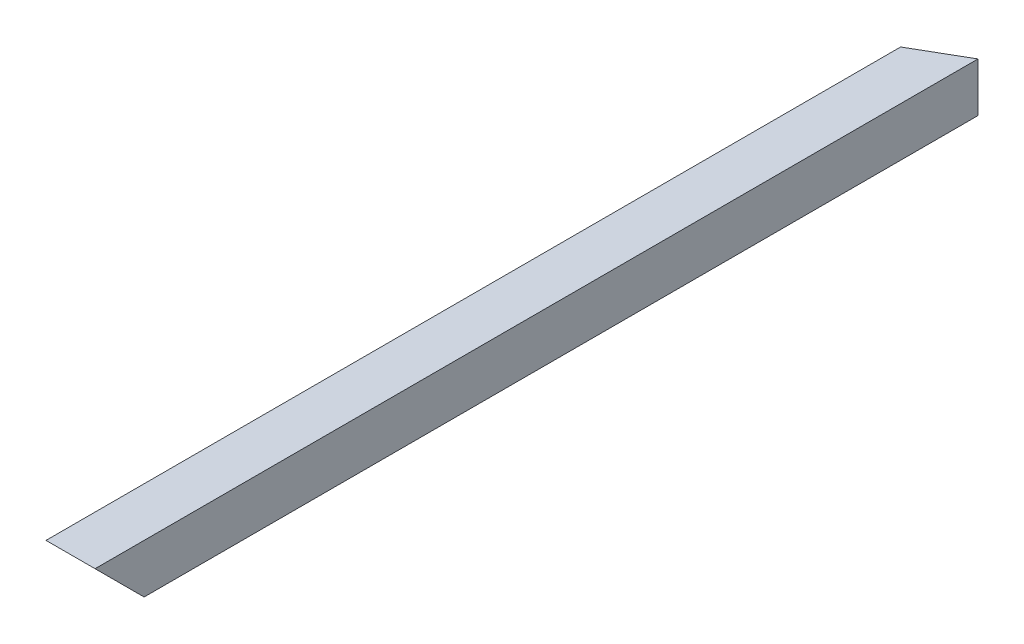
ISO-10303-21;
HEADER;
FILE_DESCRIPTION(('STEP AP214'),'2;1');
FILE_NAME('part.step','',(''),(''),'','','');
FILE_SCHEMA(('AUTOMOTIVE_DESIGN { 1 0 10303 214 1 1 1 1 }'));
ENDSEC;
DATA;
#1=APPLICATION_CONTEXT('core data for automotive mechanical design processes');
#2=APPLICATION_PROTOCOL_DEFINITION('international standard','automotive_design',2000,#1);
#3=PRODUCT_CONTEXT('',#1,'mechanical');
#4=PRODUCT('Part','Part','',(#3));
#5=PRODUCT_RELATED_PRODUCT_CATEGORY('part','',(#4));
#6=PRODUCT_DEFINITION_FORMATION('','',#4);
#7=PRODUCT_DEFINITION_CONTEXT('part definition',#1,'design');
#8=PRODUCT_DEFINITION('design','',#6,#7);
#9=PRODUCT_DEFINITION_SHAPE('','',#8);
#10=(LENGTH_UNIT() NAMED_UNIT(*) SI_UNIT(.MILLI.,.METRE.));
#11=(NAMED_UNIT(*) PLANE_ANGLE_UNIT() SI_UNIT($,.RADIAN.));
#12=(NAMED_UNIT(*) SI_UNIT($,.STERADIAN.) SOLID_ANGLE_UNIT());
#13=UNCERTAINTY_MEASURE_WITH_UNIT(LENGTH_MEASURE(1.E-05),#10,'distance_accuracy_value','');
#14=(GEOMETRIC_REPRESENTATION_CONTEXT(3) GLOBAL_UNCERTAINTY_ASSIGNED_CONTEXT((#13)) GLOBAL_UNIT_ASSIGNED_CONTEXT((#10,
#11,#12)) REPRESENTATION_CONTEXT('',''));
#15=CARTESIAN_POINT('',(0.,0.,0.));
#16=DIRECTION('',(0.,0.,1.));
#17=DIRECTION('',(1.,0.,0.));
#18=AXIS2_PLACEMENT_3D('',#15,#16,#17);
#19=CARTESIAN_POINT('',(-12.7,12.7,-213.935303162583));
#20=DIRECTION('',(0.500000000000001,0.,0.866025403784438));
#21=DIRECTION('',(0.866025403784438,0.,-0.500000000000001));
#22=AXIS2_PLACEMENT_3D('',#19,#20,#21);
#23=PLANE('',#22);
#24=DIRECTION('',(0.866025403784438,0.,-0.500000000000001));
#25=VECTOR('',#24,1.);
#26=CARTESIAN_POINT('',(-49.4933518262807,-12.7,-192.692651581292));
#27=LINE('',#26,#25);
#28=CARTESIAN_POINT('',(-12.7,-12.7,-213.935303162583));
#29=VERTEX_POINT('',#28);
#30=CARTESIAN_POINT('',(12.7,-12.7,-228.6));
#31=VERTEX_POINT('',#30);
#32=EDGE_CURVE('E35',#29,#31,#27,.T.);
#33=ORIENTED_EDGE('',*,*,#32,.F.);
#34=DIRECTION('',(0.,-1.,0.));
#35=VECTOR('',#34,1.);
#36=CARTESIAN_POINT('',(-12.7,0.,-213.935303162584));
#37=LINE('',#36,#35);
#38=CARTESIAN_POINT('',(-12.7,12.7,-213.935303162583));
#39=VERTEX_POINT('',#38);
#40=EDGE_CURVE('E128',#39,#29,#37,.T.);
#41=ORIENTED_EDGE('',*,*,#40,.F.);
#42=DIRECTION('',(-0.866025403784438,0.,0.500000000000001));
#43=VECTOR('',#42,1.);
#44=CARTESIAN_POINT('',(-59.0183518262807,12.7,-187.193390267261));
#45=LINE('',#44,#43);
#46=CARTESIAN_POINT('',(12.7,12.7,-228.6));
#47=VERTEX_POINT('',#46);
#48=EDGE_CURVE('E124',#47,#39,#45,.T.);
#49=ORIENTED_EDGE('',*,*,#48,.F.);
#50=DIRECTION('',(0.,1.,0.));
#51=VECTOR('',#50,1.);
#52=CARTESIAN_POINT('',(12.7,12.7,-228.6));
#53=LINE('',#52,#51);
#54=EDGE_CURVE('E122',#31,#47,#53,.T.);
#55=ORIENTED_EDGE('',*,*,#54,.F.);
#56=EDGE_LOOP('',(#33,#41,#49,#55));
#57=FACE_BOUND('',#56,.T.);
#58=DIRECTION('',(0.,1.,0.));
#59=VECTOR('',#58,1.);
#60=CARTESIAN_POINT('',(-9.52500000000001,1.5875,-215.768390267261));
#61=LINE('',#60,#59);
#62=CARTESIAN_POINT('',(-9.525,-9.525,-215.768390267261));
#63=VERTEX_POINT('',#62);
#64=CARTESIAN_POINT('',(-9.525,9.525,-215.768390267261));
#65=VERTEX_POINT('',#64);
#66=EDGE_CURVE('E108',#63,#65,#61,.T.);
#67=ORIENTED_EDGE('',*,*,#66,.F.);
#68=DIRECTION('',(-0.866025403784438,0.,0.500000000000001));
#69=VECTOR('',#68,1.);
#70=CARTESIAN_POINT('',(-50.6839768262807,-9.525,-192.005243917038));
#71=LINE('',#70,#69);
#72=CARTESIAN_POINT('',(9.525,-9.525,-226.766912895323));
#73=VERTEX_POINT('',#72);
#74=EDGE_CURVE('E134',#73,#63,#71,.T.);
#75=ORIENTED_EDGE('',*,*,#74,.F.);
#76=DIRECTION('',(0.,-1.,0.));
#77=VECTOR('',#76,1.);
#78=CARTESIAN_POINT('',(9.52500000000001,11.1125,-226.766912895323));
#79=LINE('',#78,#77);
#80=CARTESIAN_POINT('',(9.525,9.525,-226.766912895323));
#81=VERTEX_POINT('',#80);
#82=EDGE_CURVE('E10',#81,#73,#79,.T.);
#83=ORIENTED_EDGE('',*,*,#82,.F.);
#84=DIRECTION('',(0.866025403784438,0.,-0.500000000000001));
#85=VECTOR('',#84,1.);
#86=CARTESIAN_POINT('',(-57.8277268262807,9.525,-187.880797931514));
#87=LINE('',#86,#85);
#88=EDGE_CURVE('E94',#65,#81,#87,.T.);
#89=ORIENTED_EDGE('',*,*,#88,.F.);
#90=EDGE_LOOP('',(#67,#75,#83,#89));
#91=FACE_BOUND('',#90,.T.);
#92=ADVANCED_FACE('F16',(#57,#91),#23,.F.);
#93=CARTESIAN_POINT('',(9.525,9.525,0.));
#94=DIRECTION('',(1.,0.,0.));
#95=DIRECTION('',(0.,0.,-1.));
#96=AXIS2_PLACEMENT_3D('',#93,#94,#95);
#97=PLANE('',#96);
#98=ORIENTED_EDGE('',*,*,#82,.T.);
#99=DIRECTION('',(0.,0.,1.));
#100=VECTOR('',#99,1.);
#101=CARTESIAN_POINT('',(9.525,-9.525,0.));
#102=LINE('',#101,#100);
#103=CARTESIAN_POINT('',(9.525,-9.525,206.375));
#104=VERTEX_POINT('',#103);
#105=EDGE_CURVE('E26',#73,#104,#102,.T.);
#106=ORIENTED_EDGE('',*,*,#105,.T.);
#107=DIRECTION('',(0.,0.707106781186548,0.707106781186547));
#108=VECTOR('',#107,1.);
#109=CARTESIAN_POINT('',(9.525,-45.24375,170.65625));
#110=LINE('',#109,#108);
#111=CARTESIAN_POINT('',(9.525,9.525,225.425));
#112=VERTEX_POINT('',#111);
#113=EDGE_CURVE('E136',#104,#112,#110,.T.);
#114=ORIENTED_EDGE('',*,*,#113,.T.);
#115=DIRECTION('',(0.,0.,-1.));
#116=VECTOR('',#115,1.);
#117=CARTESIAN_POINT('',(9.525,9.525,0.));
#118=LINE('',#117,#116);
#119=EDGE_CURVE('E91',#112,#81,#118,.T.);
#120=ORIENTED_EDGE('',*,*,#119,.T.);
#121=EDGE_LOOP('',(#98,#106,#114,#120));
#122=FACE_BOUND('',#121,.T.);
#123=ADVANCED_FACE('F165',(#122),#97,.F.);
#124=CARTESIAN_POINT('',(9.525,-9.525,0.));
#125=DIRECTION('',(0.,-1.,0.));
#126=DIRECTION('',(0.,0.,-1.));
#127=AXIS2_PLACEMENT_3D('',#124,#125,#126);
#128=PLANE('',#127);
#129=ORIENTED_EDGE('',*,*,#74,.T.);
#130=DIRECTION('',(0.,0.,1.));
#131=VECTOR('',#130,1.);
#132=CARTESIAN_POINT('',(-9.525,-9.525,0.));
#133=LINE('',#132,#131);
#134=CARTESIAN_POINT('',(-9.525,-9.525,206.375));
#135=VERTEX_POINT('',#134);
#136=EDGE_CURVE('E132',#63,#135,#133,.T.);
#137=ORIENTED_EDGE('',*,*,#136,.T.);
#138=DIRECTION('',(1.,0.,0.));
#139=VECTOR('',#138,1.);
#140=CARTESIAN_POINT('',(-1.5875,-9.52500000000001,206.375));
#141=LINE('',#140,#139);
#142=EDGE_CURVE('E101',#135,#104,#141,.T.);
#143=ORIENTED_EDGE('',*,*,#142,.T.);
#144=ORIENTED_EDGE('',*,*,#105,.F.);
#145=EDGE_LOOP('',(#129,#137,#143,#144));
#146=FACE_BOUND('',#145,.T.);
#147=ADVANCED_FACE('F170',(#146),#128,.F.);
#148=CARTESIAN_POINT('',(-12.7,-12.7,0.));
#149=DIRECTION('',(-1.,0.,0.));
#150=DIRECTION('',(0.,0.,1.));
#151=AXIS2_PLACEMENT_3D('',#148,#149,#150);
#152=PLANE('',#151);
#153=ORIENTED_EDGE('',*,*,#40,.T.);
#154=DIRECTION('',(0.,0.,-1.));
#155=VECTOR('',#154,1.);
#156=CARTESIAN_POINT('',(-12.7,-12.7,0.));
#157=LINE('',#156,#155);
#158=CARTESIAN_POINT('',(-12.7,-12.7,203.2));
#159=VERTEX_POINT('',#158);
#160=EDGE_CURVE('E109',#159,#29,#157,.T.);
#161=ORIENTED_EDGE('',*,*,#160,.F.);
#162=DIRECTION('',(0.,0.707106781186548,0.707106781186547));
#163=VECTOR('',#162,1.);
#164=CARTESIAN_POINT('',(-12.7,-50.8,165.1));
#165=LINE('',#164,#163);
#166=CARTESIAN_POINT('',(-12.7,12.7,228.6));
#167=VERTEX_POINT('',#166);
#168=EDGE_CURVE('E125',#159,#167,#165,.T.);
#169=ORIENTED_EDGE('',*,*,#168,.T.);
#170=DIRECTION('',(0.,0.,1.));
#171=VECTOR('',#170,1.);
#172=CARTESIAN_POINT('',(-12.7,12.7,0.));
#173=LINE('',#172,#171);
#174=EDGE_CURVE('E113',#39,#167,#173,.T.);
#175=ORIENTED_EDGE('',*,*,#174,.F.);
#176=EDGE_LOOP('',(#153,#161,#169,#175));
#177=FACE_BOUND('',#176,.T.);
#178=ADVANCED_FACE('F157',(#177),#152,.T.);
#179=CARTESIAN_POINT('',(12.7,-12.7,0.));
#180=DIRECTION('',(0.,-1.,0.));
#181=DIRECTION('',(0.,0.,-1.));
#182=AXIS2_PLACEMENT_3D('',#179,#180,#181);
#183=PLANE('',#182);
#184=ORIENTED_EDGE('',*,*,#32,.T.);
#185=DIRECTION('',(0.,0.,-1.));
#186=VECTOR('',#185,1.);
#187=CARTESIAN_POINT('',(12.7,-12.7,0.));
#188=LINE('',#187,#186);
#189=CARTESIAN_POINT('',(12.7,-12.7,203.2));
#190=VERTEX_POINT('',#189);
#191=EDGE_CURVE('E116',#190,#31,#188,.T.);
#192=ORIENTED_EDGE('',*,*,#191,.F.);
#193=DIRECTION('',(-1.,0.,0.));
#194=VECTOR('',#193,1.);
#195=CARTESIAN_POINT('',(0.,-12.7,203.2));
#196=LINE('',#195,#194);
#197=EDGE_CURVE('E117',#190,#159,#196,.T.);
#198=ORIENTED_EDGE('',*,*,#197,.T.);
#199=ORIENTED_EDGE('',*,*,#160,.T.);
#200=EDGE_LOOP('',(#184,#192,#198,#199));
#201=FACE_BOUND('',#200,.T.);
#202=ADVANCED_FACE('F148',(#201),#183,.T.);
#203=CARTESIAN_POINT('',(-12.7,12.7,228.6));
#204=DIRECTION('',(0.,0.707106781186547,-0.707106781186548));
#205=DIRECTION('',(0.,0.707106781186548,0.707106781186547));
#206=AXIS2_PLACEMENT_3D('',#203,#204,#205);
#207=PLANE('',#206);
#208=DIRECTION('',(0.,-0.707106781186548,-0.707106781186547));
#209=VECTOR('',#208,1.);
#210=CARTESIAN_POINT('',(12.7,-44.45,171.45));
#211=LINE('',#210,#209);
#212=CARTESIAN_POINT('',(12.7,12.7,228.6));
#213=VERTEX_POINT('',#212);
#214=EDGE_CURVE('E95',#213,#190,#211,.T.);
#215=ORIENTED_EDGE('',*,*,#214,.F.);
#216=DIRECTION('',(1.,0.,0.));
#217=VECTOR('',#216,1.);
#218=CARTESIAN_POINT('',(-12.7,12.7,228.6));
#219=LINE('',#218,#217);
#220=EDGE_CURVE('E79',#167,#213,#219,.T.);
#221=ORIENTED_EDGE('',*,*,#220,.F.);
#222=ORIENTED_EDGE('',*,*,#168,.F.);
#223=ORIENTED_EDGE('',*,*,#197,.F.);
#224=EDGE_LOOP('',(#215,#221,#222,#223));
#225=FACE_BOUND('',#224,.T.);
#226=ORIENTED_EDGE('',*,*,#113,.F.);
#227=ORIENTED_EDGE('',*,*,#142,.F.);
#228=DIRECTION('',(0.,-0.707106781186548,-0.707106781186547));
#229=VECTOR('',#228,1.);
#230=CARTESIAN_POINT('',(-9.525,-50.00625,165.89375));
#231=LINE('',#230,#229);
#232=CARTESIAN_POINT('',(-9.525,9.525,225.425));
#233=VERTEX_POINT('',#232);
#234=EDGE_CURVE('E98',#233,#135,#231,.T.);
#235=ORIENTED_EDGE('',*,*,#234,.F.);
#236=DIRECTION('',(-1.,0.,0.));
#237=VECTOR('',#236,1.);
#238=CARTESIAN_POINT('',(-11.1125,9.52500000000001,225.425));
#239=LINE('',#238,#237);
#240=EDGE_CURVE('E85',#112,#233,#239,.T.);
#241=ORIENTED_EDGE('',*,*,#240,.F.);
#242=EDGE_LOOP('',(#226,#227,#235,#241));
#243=FACE_BOUND('',#242,.T.);
#244=ADVANCED_FACE('F99',(#225,#243),#207,.F.);
#245=CARTESIAN_POINT('',(-9.525,-9.525,0.));
#246=DIRECTION('',(-1.,0.,0.));
#247=DIRECTION('',(0.,0.,1.));
#248=AXIS2_PLACEMENT_3D('',#245,#246,#247);
#249=PLANE('',#248);
#250=ORIENTED_EDGE('',*,*,#66,.T.);
#251=DIRECTION('',(0.,0.,1.));
#252=VECTOR('',#251,1.);
#253=CARTESIAN_POINT('',(-9.525,9.525,0.));
#254=LINE('',#253,#252);
#255=EDGE_CURVE('E89',#65,#233,#254,.T.);
#256=ORIENTED_EDGE('',*,*,#255,.T.);
#257=ORIENTED_EDGE('',*,*,#234,.T.);
#258=ORIENTED_EDGE('',*,*,#136,.F.);
#259=EDGE_LOOP('',(#250,#256,#257,#258));
#260=FACE_BOUND('',#259,.T.);
#261=ADVANCED_FACE('F107',(#260),#249,.F.);
#262=CARTESIAN_POINT('',(-9.525,9.525,0.));
#263=DIRECTION('',(0.,1.,0.));
#264=DIRECTION('',(0.,0.,1.));
#265=AXIS2_PLACEMENT_3D('',#262,#263,#264);
#266=PLANE('',#265);
#267=ORIENTED_EDGE('',*,*,#88,.T.);
#268=ORIENTED_EDGE('',*,*,#119,.F.);
#269=ORIENTED_EDGE('',*,*,#240,.T.);
#270=ORIENTED_EDGE('',*,*,#255,.F.);
#271=EDGE_LOOP('',(#267,#268,#269,#270));
#272=FACE_BOUND('',#271,.T.);
#273=ADVANCED_FACE('F87',(#272),#266,.F.);
#274=CARTESIAN_POINT('',(12.7,12.7,0.));
#275=DIRECTION('',(1.,0.,0.));
#276=DIRECTION('',(0.,0.,-1.));
#277=AXIS2_PLACEMENT_3D('',#274,#275,#276);
#278=PLANE('',#277);
#279=ORIENTED_EDGE('',*,*,#214,.T.);
#280=ORIENTED_EDGE('',*,*,#191,.T.);
#281=ORIENTED_EDGE('',*,*,#54,.T.);
#282=DIRECTION('',(0.,0.,-1.));
#283=VECTOR('',#282,1.);
#284=CARTESIAN_POINT('',(12.7,12.7,0.));
#285=LINE('',#284,#283);
#286=EDGE_CURVE('E20',#213,#47,#285,.T.);
#287=ORIENTED_EDGE('',*,*,#286,.F.);
#288=EDGE_LOOP('',(#279,#280,#281,#287));
#289=FACE_BOUND('',#288,.T.);
#290=ADVANCED_FACE('F151',(#289),#278,.T.);
#291=CARTESIAN_POINT('',(-12.7,12.7,0.));
#292=DIRECTION('',(0.,1.,0.));
#293=DIRECTION('',(0.,0.,1.));
#294=AXIS2_PLACEMENT_3D('',#291,#292,#293);
#295=PLANE('',#294);
#296=ORIENTED_EDGE('',*,*,#48,.T.);
#297=ORIENTED_EDGE('',*,*,#174,.T.);
#298=ORIENTED_EDGE('',*,*,#220,.T.);
#299=ORIENTED_EDGE('',*,*,#286,.T.);
#300=EDGE_LOOP('',(#296,#297,#298,#299));
#301=FACE_BOUND('',#300,.T.);
#302=ADVANCED_FACE('F18',(#301),#295,.T.);
#303=CLOSED_SHELL('',(#92,#123,#147,#178,#202,#244,#261,#273,#290,#302));
#304=MANIFOLD_SOLID_BREP('B1',#303);
#305=ADVANCED_BREP_SHAPE_REPRESENTATION('',(#18,#304),#14);
#306=SHAPE_DEFINITION_REPRESENTATION(#9,#305);
ENDSEC;
END-ISO-10303-21;
